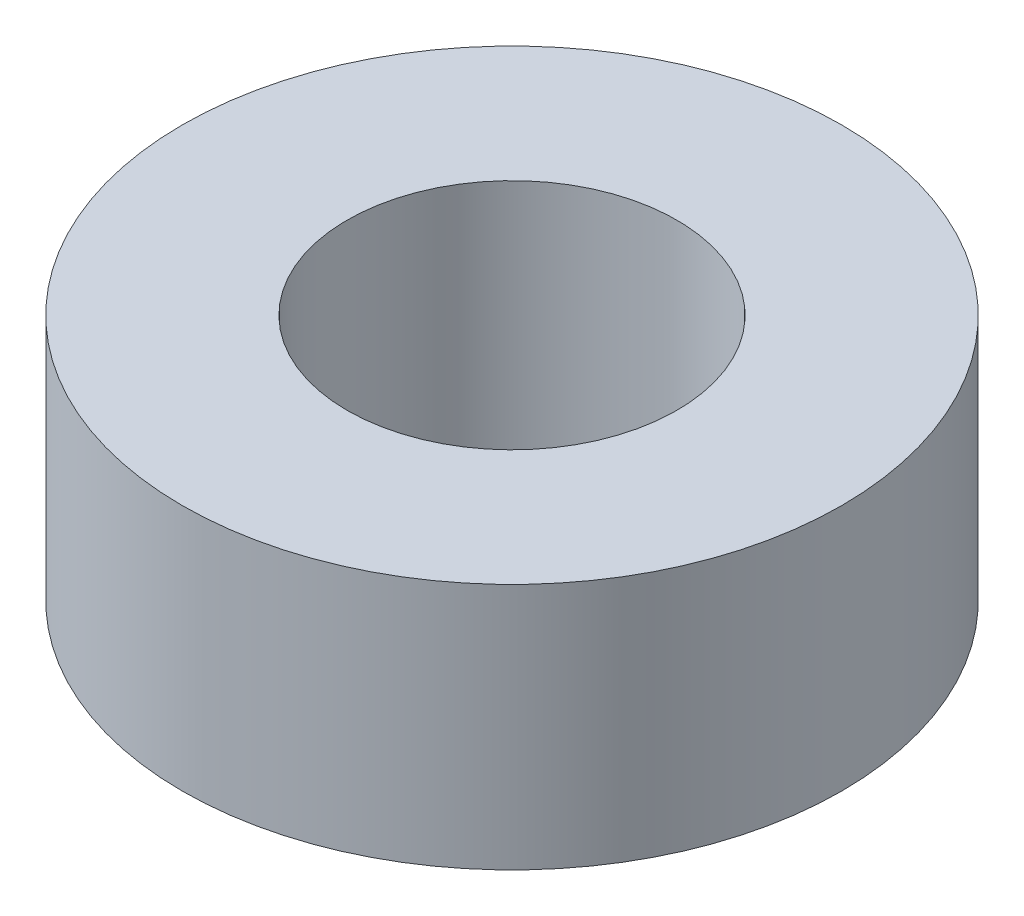
ISO-10303-21;
HEADER;
FILE_DESCRIPTION(('STEP AP214'),'2;1');
FILE_NAME('part.step','',(''),(''),'','','');
FILE_SCHEMA(('AUTOMOTIVE_DESIGN { 1 0 10303 214 1 1 1 1 }'));
ENDSEC;
DATA;
#1=APPLICATION_CONTEXT('core data for automotive mechanical design processes');
#2=APPLICATION_PROTOCOL_DEFINITION('international standard','automotive_design',2000,#1);
#3=PRODUCT_CONTEXT('',#1,'mechanical');
#4=PRODUCT('Part','Part','',(#3));
#5=PRODUCT_RELATED_PRODUCT_CATEGORY('part','',(#4));
#6=PRODUCT_DEFINITION_FORMATION('','',#4);
#7=PRODUCT_DEFINITION_CONTEXT('part definition',#1,'design');
#8=PRODUCT_DEFINITION('design','',#6,#7);
#9=PRODUCT_DEFINITION_SHAPE('','',#8);
#10=(LENGTH_UNIT() NAMED_UNIT(*) SI_UNIT(.MILLI.,.METRE.));
#11=(NAMED_UNIT(*) PLANE_ANGLE_UNIT() SI_UNIT($,.RADIAN.));
#12=(NAMED_UNIT(*) SI_UNIT($,.STERADIAN.) SOLID_ANGLE_UNIT());
#13=UNCERTAINTY_MEASURE_WITH_UNIT(LENGTH_MEASURE(1.E-05),#10,'distance_accuracy_value','');
#14=(GEOMETRIC_REPRESENTATION_CONTEXT(3) GLOBAL_UNCERTAINTY_ASSIGNED_CONTEXT((#13)) GLOBAL_UNIT_ASSIGNED_CONTEXT((#10,
#11,#12)) REPRESENTATION_CONTEXT('',''));
#15=CARTESIAN_POINT('',(0.,0.,0.));
#16=DIRECTION('',(0.,0.,1.));
#17=DIRECTION('',(1.,0.,0.));
#18=AXIS2_PLACEMENT_3D('',#15,#16,#17);
#19=CARTESIAN_POINT('',(0.,3.,0.));
#20=DIRECTION('',(0.,-1.,0.));
#21=DIRECTION('',(0.,0.,-1.));
#22=AXIS2_PLACEMENT_3D('',#19,#20,#21);
#23=CYLINDRICAL_SURFACE('',#22,4.);
#24=CARTESIAN_POINT('',(0.,3.,0.));
#25=DIRECTION('',(0.,1.,0.));
#26=DIRECTION('',(0.,0.,1.));
#27=AXIS2_PLACEMENT_3D('',#24,#25,#26);
#28=CIRCLE('',#27,4.);
#29=CARTESIAN_POINT('',(0.,3.,4.));
#30=VERTEX_POINT('',#29);
#31=EDGE_CURVE('E10',#30,#30,#28,.T.);
#32=ORIENTED_EDGE('',*,*,#31,.F.);
#33=EDGE_LOOP('',(#32));
#34=FACE_BOUND('',#33,.T.);
#35=CARTESIAN_POINT('',(0.,0.,0.));
#36=DIRECTION('',(0.,1.,0.));
#37=DIRECTION('',(0.,0.,1.));
#38=AXIS2_PLACEMENT_3D('',#35,#36,#37);
#39=CIRCLE('',#38,4.);
#40=CARTESIAN_POINT('',(0.,0.,4.));
#41=VERTEX_POINT('',#40);
#42=EDGE_CURVE('E34',#41,#41,#39,.T.);
#43=ORIENTED_EDGE('',*,*,#42,.T.);
#44=EDGE_LOOP('',(#43));
#45=FACE_BOUND('',#44,.T.);
#46=ADVANCED_FACE('F31',(#34,#45),#23,.T.);
#47=CARTESIAN_POINT('',(0.,3.,0.));
#48=DIRECTION('',(0.,1.,0.));
#49=DIRECTION('',(0.,0.,1.));
#50=AXIS2_PLACEMENT_3D('',#47,#48,#49);
#51=PLANE('',#50);
#52=CARTESIAN_POINT('',(0.,3.,0.));
#53=DIRECTION('',(0.,1.,0.));
#54=DIRECTION('',(0.,0.,1.));
#55=AXIS2_PLACEMENT_3D('',#52,#53,#54);
#56=CIRCLE('',#55,2.);
#57=CARTESIAN_POINT('',(0.,3.,2.));
#58=VERTEX_POINT('',#57);
#59=EDGE_CURVE('E41',#58,#58,#56,.T.);
#60=ORIENTED_EDGE('',*,*,#59,.F.);
#61=EDGE_LOOP('',(#60));
#62=FACE_BOUND('',#61,.T.);
#63=ORIENTED_EDGE('',*,*,#31,.T.);
#64=EDGE_LOOP('',(#63));
#65=FACE_BOUND('',#64,.T.);
#66=ADVANCED_FACE('F52',(#62,#65),#51,.T.);
#67=CARTESIAN_POINT('',(0.,0.,0.));
#68=DIRECTION('',(0.,1.,0.));
#69=DIRECTION('',(0.,0.,1.));
#70=AXIS2_PLACEMENT_3D('',#67,#68,#69);
#71=PLANE('',#70);
#72=CARTESIAN_POINT('',(0.,0.,0.));
#73=DIRECTION('',(0.,1.,0.));
#74=DIRECTION('',(0.,0.,1.));
#75=AXIS2_PLACEMENT_3D('',#72,#73,#74);
#76=CIRCLE('',#75,2.);
#77=CARTESIAN_POINT('',(0.,0.,2.));
#78=VERTEX_POINT('',#77);
#79=EDGE_CURVE('E43',#78,#78,#76,.T.);
#80=ORIENTED_EDGE('',*,*,#79,.T.);
#81=EDGE_LOOP('',(#80));
#82=FACE_BOUND('',#81,.T.);
#83=ORIENTED_EDGE('',*,*,#42,.F.);
#84=EDGE_LOOP('',(#83));
#85=FACE_BOUND('',#84,.T.);
#86=ADVANCED_FACE('F54',(#82,#85),#71,.F.);
#87=CARTESIAN_POINT('',(0.,3.,0.));
#88=DIRECTION('',(0.,-1.,0.));
#89=DIRECTION('',(0.,0.,-1.));
#90=AXIS2_PLACEMENT_3D('',#87,#88,#89);
#91=CYLINDRICAL_SURFACE('',#90,2.);
#92=ORIENTED_EDGE('',*,*,#59,.T.);
#93=EDGE_LOOP('',(#92));
#94=FACE_BOUND('',#93,.T.);
#95=ORIENTED_EDGE('',*,*,#79,.F.);
#96=EDGE_LOOP('',(#95));
#97=FACE_BOUND('',#96,.T.);
#98=ADVANCED_FACE('F49',(#94,#97),#91,.F.);
#99=CLOSED_SHELL('',(#46,#66,#86,#98));
#100=MANIFOLD_SOLID_BREP('B2',#99);
#101=ADVANCED_BREP_SHAPE_REPRESENTATION('',(#18,#100),#14);
#102=SHAPE_DEFINITION_REPRESENTATION(#9,#101);
ENDSEC;
END-ISO-10303-21;
